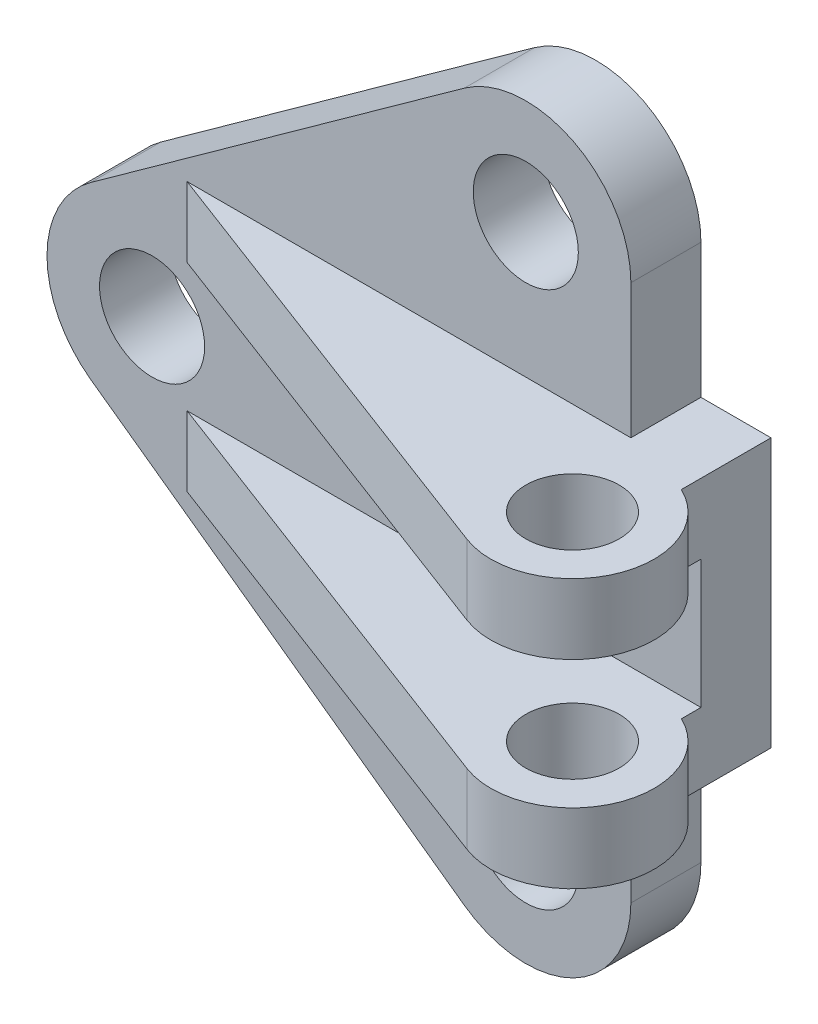
ISO-10303-21;
HEADER;
FILE_DESCRIPTION(('STEP AP214'),'2;1');
FILE_NAME('part.step','',(''),(''),'','','');
FILE_SCHEMA(('AUTOMOTIVE_DESIGN { 1 0 10303 214 1 1 1 1 }'));
ENDSEC;
DATA;
#1=APPLICATION_CONTEXT('core data for automotive mechanical design processes');
#2=APPLICATION_PROTOCOL_DEFINITION('international standard','automotive_design',2000,#1);
#3=PRODUCT_CONTEXT('',#1,'mechanical');
#4=PRODUCT('Part','Part','',(#3));
#5=PRODUCT_RELATED_PRODUCT_CATEGORY('part','',(#4));
#6=PRODUCT_DEFINITION_FORMATION('','',#4);
#7=PRODUCT_DEFINITION_CONTEXT('part definition',#1,'design');
#8=PRODUCT_DEFINITION('design','',#6,#7);
#9=PRODUCT_DEFINITION_SHAPE('','',#8);
#10=(LENGTH_UNIT() NAMED_UNIT(*) SI_UNIT(.MILLI.,.METRE.));
#11=(NAMED_UNIT(*) PLANE_ANGLE_UNIT() SI_UNIT($,.RADIAN.));
#12=(NAMED_UNIT(*) SI_UNIT($,.STERADIAN.) SOLID_ANGLE_UNIT());
#13=UNCERTAINTY_MEASURE_WITH_UNIT(LENGTH_MEASURE(1.E-05),#10,'distance_accuracy_value','');
#14=(GEOMETRIC_REPRESENTATION_CONTEXT(3) GLOBAL_UNCERTAINTY_ASSIGNED_CONTEXT((#13)) GLOBAL_UNIT_ASSIGNED_CONTEXT((#10,
#11,#12)) REPRESENTATION_CONTEXT('',''));
#15=CARTESIAN_POINT('',(0.,0.,0.));
#16=DIRECTION('',(0.,0.,1.));
#17=DIRECTION('',(1.,0.,0.));
#18=AXIS2_PLACEMENT_3D('',#15,#16,#17);
#19=CARTESIAN_POINT('',(0.,0.,12.));
#20=DIRECTION('',(0.,0.,1.));
#21=DIRECTION('',(1.,0.,0.));
#22=AXIS2_PLACEMENT_3D('',#19,#20,#21);
#23=PLANE('',#22);
#24=CARTESIAN_POINT('',(64.,46.,12.));
#25=DIRECTION('',(0.,0.,1.));
#26=DIRECTION('',(1.,0.,0.));
#27=AXIS2_PLACEMENT_3D('',#24,#25,#26);
#28=CIRCLE('',#27,9.);
#29=CARTESIAN_POINT('',(73.,46.,12.));
#30=VERTEX_POINT('',#29);
#31=EDGE_CURVE('E281',#30,#30,#28,.T.);
#32=ORIENTED_EDGE('',*,*,#31,.F.);
#33=EDGE_LOOP('',(#32));
#34=FACE_BOUND('',#33,.T.);
#35=CARTESIAN_POINT('',(0.,0.,12.));
#36=DIRECTION('',(0.,0.,1.));
#37=DIRECTION('',(1.,0.,0.));
#38=AXIS2_PLACEMENT_3D('',#35,#36,#37);
#39=CIRCLE('',#38,9.);
#40=CARTESIAN_POINT('',(9.,0.,12.));
#41=VERTEX_POINT('',#40);
#42=EDGE_CURVE('E289',#41,#41,#39,.T.);
#43=ORIENTED_EDGE('',*,*,#42,.F.);
#44=EDGE_LOOP('',(#43));
#45=FACE_BOUND('',#44,.T.);
#46=CARTESIAN_POINT('',(64.,-46.,12.));
#47=DIRECTION('',(0.,0.,1.));
#48=DIRECTION('',(1.,0.,0.));
#49=AXIS2_PLACEMENT_3D('',#46,#47,#48);
#50=CIRCLE('',#49,9.);
#51=CARTESIAN_POINT('',(73.,-46.,12.));
#52=VERTEX_POINT('',#51);
#53=EDGE_CURVE('E273',#52,#52,#50,.T.);
#54=ORIENTED_EDGE('',*,*,#53,.F.);
#55=EDGE_LOOP('',(#54));
#56=FACE_BOUND('',#55,.T.);
#57=DIRECTION('',(0.,-1.,0.));
#58=VECTOR('',#57,1.);
#59=CARTESIAN_POINT('',(94.,23.,12.));
#60=LINE('',#59,#58);
#61=CARTESIAN_POINT('',(94.,11.,12.));
#62=VERTEX_POINT('',#61);
#63=CARTESIAN_POINT('',(94.,-11.,12.));
#64=VERTEX_POINT('',#63);
#65=EDGE_CURVE('E60',#62,#64,#60,.T.);
#66=ORIENTED_EDGE('',*,*,#65,.F.);
#67=DIRECTION('',(1.,0.,0.));
#68=VECTOR('',#67,1.);
#69=CARTESIAN_POINT('',(5.99999999999999,11.,12.));
#70=LINE('',#69,#68);
#71=CARTESIAN_POINT('',(5.99999999999999,11.,12.));
#72=VERTEX_POINT('',#71);
#73=EDGE_CURVE('E158',#72,#62,#70,.T.);
#74=ORIENTED_EDGE('',*,*,#73,.F.);
#75=DIRECTION('',(0.,1.,0.));
#76=VECTOR('',#75,1.);
#77=CARTESIAN_POINT('',(5.99999999999999,11.,12.));
#78=LINE('',#77,#76);
#79=CARTESIAN_POINT('',(5.99999999999999,23.,12.));
#80=VERTEX_POINT('',#79);
#81=EDGE_CURVE('E172',#72,#80,#78,.T.);
#82=ORIENTED_EDGE('',*,*,#81,.T.);
#83=DIRECTION('',(1.,0.,0.));
#84=VECTOR('',#83,1.);
#85=CARTESIAN_POINT('',(5.99999999999999,23.,12.));
#86=LINE('',#85,#84);
#87=CARTESIAN_POINT('',(82.,23.,12.));
#88=VERTEX_POINT('',#87);
#89=EDGE_CURVE('E182',#80,#88,#86,.T.);
#90=ORIENTED_EDGE('',*,*,#89,.T.);
#91=DIRECTION('',(0.,1.,0.));
#92=VECTOR('',#91,1.);
#93=CARTESIAN_POINT('',(82.,46.,12.));
#94=LINE('',#93,#92);
#95=CARTESIAN_POINT('',(82.,46.,12.));
#96=VERTEX_POINT('',#95);
#97=EDGE_CURVE('E308',#88,#96,#94,.T.);
#98=ORIENTED_EDGE('',*,*,#97,.T.);
#99=CARTESIAN_POINT('',(64.,46.,12.));
#100=DIRECTION('',(0.,0.,1.));
#101=DIRECTION('',(1.,0.,0.));
#102=AXIS2_PLACEMENT_3D('',#99,#100,#101);
#103=CIRCLE('',#102,18.);
#104=CARTESIAN_POINT('',(53.4945511332536,60.6162766841688,12.));
#105=VERTEX_POINT('',#104);
#106=EDGE_CURVE('E313',#96,#105,#103,.T.);
#107=ORIENTED_EDGE('',*,*,#106,.T.);
#108=DIRECTION('',(-0.812015371342713,-0.583636048152575,0.));
#109=VECTOR('',#108,1.);
#110=CARTESIAN_POINT('',(-10.5054488667464,14.6162766841688,12.));
#111=LINE('',#110,#109);
#112=CARTESIAN_POINT('',(-10.5054488667464,14.6162766841688,12.));
#113=VERTEX_POINT('',#112);
#114=EDGE_CURVE('E316',#105,#113,#111,.T.);
#115=ORIENTED_EDGE('',*,*,#114,.T.);
#116=CARTESIAN_POINT('',(0.,0.,12.));
#117=DIRECTION('',(0.,0.,1.));
#118=DIRECTION('',(1.,0.,0.));
#119=AXIS2_PLACEMENT_3D('',#116,#117,#118);
#120=CIRCLE('',#119,18.);
#121=CARTESIAN_POINT('',(-10.5054488667464,-14.6162766841688,12.));
#122=VERTEX_POINT('',#121);
#123=EDGE_CURVE('E297',#113,#122,#120,.T.);
#124=ORIENTED_EDGE('',*,*,#123,.T.);
#125=DIRECTION('',(0.812015371342714,-0.583636048152575,0.));
#126=VECTOR('',#125,1.);
#127=CARTESIAN_POINT('',(-10.5054488667464,-14.6162766841688,12.));
#128=LINE('',#127,#126);
#129=CARTESIAN_POINT('',(53.4945511332537,-60.6162766841688,12.));
#130=VERTEX_POINT('',#129);
#131=EDGE_CURVE('E301',#122,#130,#128,.T.);
#132=ORIENTED_EDGE('',*,*,#131,.T.);
#133=CARTESIAN_POINT('',(64.,-46.,12.));
#134=DIRECTION('',(0.,0.,1.));
#135=DIRECTION('',(1.,0.,0.));
#136=AXIS2_PLACEMENT_3D('',#133,#134,#135);
#137=CIRCLE('',#136,18.);
#138=CARTESIAN_POINT('',(82.,-46.,12.));
#139=VERTEX_POINT('',#138);
#140=EDGE_CURVE('E305',#130,#139,#137,.T.);
#141=ORIENTED_EDGE('',*,*,#140,.T.);
#142=CARTESIAN_POINT('',(82.,-23.,12.));
#143=VERTEX_POINT('',#142);
#144=EDGE_CURVE('E309',#139,#143,#94,.T.);
#145=ORIENTED_EDGE('',*,*,#144,.T.);
#146=DIRECTION('',(1.,0.,0.));
#147=VECTOR('',#146,1.);
#148=CARTESIAN_POINT('',(5.99999999999999,-23.,12.));
#149=LINE('',#148,#147);
#150=CARTESIAN_POINT('',(5.99999999999999,-23.,12.));
#151=VERTEX_POINT('',#150);
#152=EDGE_CURVE('E217',#151,#143,#149,.T.);
#153=ORIENTED_EDGE('',*,*,#152,.F.);
#154=DIRECTION('',(0.,-1.,0.));
#155=VECTOR('',#154,1.);
#156=CARTESIAN_POINT('',(5.99999999999999,-11.,12.));
#157=LINE('',#156,#155);
#158=CARTESIAN_POINT('',(5.99999999999999,-11.,12.));
#159=VERTEX_POINT('',#158);
#160=EDGE_CURVE('E243',#159,#151,#157,.T.);
#161=ORIENTED_EDGE('',*,*,#160,.F.);
#162=DIRECTION('',(1.,0.,0.));
#163=VECTOR('',#162,1.);
#164=CARTESIAN_POINT('',(5.99999999999999,-11.,12.));
#165=LINE('',#164,#163);
#166=EDGE_CURVE('E221',#159,#64,#165,.T.);
#167=ORIENTED_EDGE('',*,*,#166,.T.);
#168=EDGE_LOOP('',(#66,#74,#82,#90,#98,#107,#115,#124,#132,#141,#145,#153,#161,#167));
#169=FACE_BOUND('',#168,.T.);
#170=ADVANCED_FACE('F39',(#34,#45,#56,#169),#23,.T.);
#171=CARTESIAN_POINT('',(82.,46.,12.));
#172=DIRECTION('',(-1.,0.,0.));
#173=DIRECTION('',(0.,0.,1.));
#174=AXIS2_PLACEMENT_3D('',#171,#172,#173);
#175=PLANE('',#174);
#176=DIRECTION('',(0.,0.,1.));
#177=VECTOR('',#176,1.);
#178=CARTESIAN_POINT('',(82.,23.,0.));
#179=LINE('',#178,#177);
#180=CARTESIAN_POINT('',(82.,23.,0.));
#181=VERTEX_POINT('',#180);
#182=EDGE_CURVE('E251',#181,#88,#179,.T.);
#183=ORIENTED_EDGE('',*,*,#182,.F.);
#184=DIRECTION('',(0.,1.,0.));
#185=VECTOR('',#184,1.);
#186=CARTESIAN_POINT('',(82.,46.,0.));
#187=LINE('',#186,#185);
#188=CARTESIAN_POINT('',(82.,46.,0.));
#189=VERTEX_POINT('',#188);
#190=EDGE_CURVE('E329',#181,#189,#187,.T.);
#191=ORIENTED_EDGE('',*,*,#190,.T.);
#192=DIRECTION('',(0.,0.,-1.));
#193=VECTOR('',#192,1.);
#194=CARTESIAN_POINT('',(82.,46.,12.));
#195=LINE('',#194,#193);
#196=EDGE_CURVE('E346',#96,#189,#195,.T.);
#197=ORIENTED_EDGE('',*,*,#196,.F.);
#198=ORIENTED_EDGE('',*,*,#97,.F.);
#199=EDGE_LOOP('',(#183,#191,#197,#198));
#200=FACE_BOUND('',#199,.T.);
#201=ADVANCED_FACE('F393',(#200),#175,.F.);
#202=CARTESIAN_POINT('',(0.,0.,0.));
#203=DIRECTION('',(0.,0.,1.));
#204=DIRECTION('',(1.,0.,0.));
#205=AXIS2_PLACEMENT_3D('',#202,#203,#204);
#206=PLANE('',#205);
#207=CARTESIAN_POINT('',(0.,0.,0.));
#208=DIRECTION('',(0.,0.,1.));
#209=DIRECTION('',(1.,0.,0.));
#210=AXIS2_PLACEMENT_3D('',#207,#208,#209);
#211=CIRCLE('',#210,18.);
#212=CARTESIAN_POINT('',(-10.5054488667464,14.6162766841688,0.));
#213=VERTEX_POINT('',#212);
#214=CARTESIAN_POINT('',(-10.5054488667464,-14.6162766841688,0.));
#215=VERTEX_POINT('',#214);
#216=EDGE_CURVE('E293',#213,#215,#211,.T.);
#217=ORIENTED_EDGE('',*,*,#216,.F.);
#218=DIRECTION('',(-0.812015371342713,-0.583636048152575,0.));
#219=VECTOR('',#218,1.);
#220=CARTESIAN_POINT('',(-10.5054488667464,14.6162766841688,0.));
#221=LINE('',#220,#219);
#222=CARTESIAN_POINT('',(53.4945511332536,60.6162766841688,0.));
#223=VERTEX_POINT('',#222);
#224=EDGE_CURVE('E302',#223,#213,#221,.T.);
#225=ORIENTED_EDGE('',*,*,#224,.F.);
#226=CARTESIAN_POINT('',(64.,46.,0.));
#227=DIRECTION('',(0.,0.,1.));
#228=DIRECTION('',(1.,0.,0.));
#229=AXIS2_PLACEMENT_3D('',#226,#227,#228);
#230=CIRCLE('',#229,18.);
#231=EDGE_CURVE('E334',#189,#223,#230,.T.);
#232=ORIENTED_EDGE('',*,*,#231,.F.);
#233=ORIENTED_EDGE('',*,*,#190,.F.);
#234=DIRECTION('',(-1.,0.,0.));
#235=VECTOR('',#234,1.);
#236=CARTESIAN_POINT('',(94.,23.,0.));
#237=LINE('',#236,#235);
#238=CARTESIAN_POINT('',(94.,23.,0.));
#239=VERTEX_POINT('',#238);
#240=EDGE_CURVE('E260',#239,#181,#237,.T.);
#241=ORIENTED_EDGE('',*,*,#240,.F.);
#242=DIRECTION('',(0.,-1.,0.));
#243=VECTOR('',#242,1.);
#244=CARTESIAN_POINT('',(94.,23.,0.));
#245=LINE('',#244,#243);
#246=CARTESIAN_POINT('',(94.,-23.,0.));
#247=VERTEX_POINT('',#246);
#248=EDGE_CURVE('E256',#239,#247,#245,.T.);
#249=ORIENTED_EDGE('',*,*,#248,.T.);
#250=DIRECTION('',(-1.,0.,0.));
#251=VECTOR('',#250,1.);
#252=CARTESIAN_POINT('',(94.,-23.,0.));
#253=LINE('',#252,#251);
#254=CARTESIAN_POINT('',(82.,-23.,0.));
#255=VERTEX_POINT('',#254);
#256=EDGE_CURVE('E267',#247,#255,#253,.T.);
#257=ORIENTED_EDGE('',*,*,#256,.T.);
#258=CARTESIAN_POINT('',(82.,-46.,0.));
#259=VERTEX_POINT('',#258);
#260=EDGE_CURVE('E330',#259,#255,#187,.T.);
#261=ORIENTED_EDGE('',*,*,#260,.F.);
#262=CARTESIAN_POINT('',(64.,-46.,0.));
#263=DIRECTION('',(0.,0.,1.));
#264=DIRECTION('',(1.,0.,0.));
#265=AXIS2_PLACEMENT_3D('',#262,#263,#264);
#266=CIRCLE('',#265,18.);
#267=CARTESIAN_POINT('',(53.4945511332537,-60.6162766841688,0.));
#268=VERTEX_POINT('',#267);
#269=EDGE_CURVE('E326',#268,#259,#266,.T.);
#270=ORIENTED_EDGE('',*,*,#269,.F.);
#271=DIRECTION('',(0.812015371342714,-0.583636048152575,0.));
#272=VECTOR('',#271,1.);
#273=CARTESIAN_POINT('',(-10.5054488667464,-14.6162766841688,0.));
#274=LINE('',#273,#272);
#275=EDGE_CURVE('E323',#215,#268,#274,.T.);
#276=ORIENTED_EDGE('',*,*,#275,.F.);
#277=EDGE_LOOP('',(#217,#225,#232,#233,#241,#249,#257,#261,#270,#276));
#278=FACE_BOUND('',#277,.T.);
#279=CARTESIAN_POINT('',(0.,0.,0.));
#280=DIRECTION('',(0.,0.,1.));
#281=DIRECTION('',(1.,0.,0.));
#282=AXIS2_PLACEMENT_3D('',#279,#280,#281);
#283=CIRCLE('',#282,9.);
#284=CARTESIAN_POINT('',(9.,0.,0.));
#285=VERTEX_POINT('',#284);
#286=EDGE_CURVE('E285',#285,#285,#283,.T.);
#287=ORIENTED_EDGE('',*,*,#286,.T.);
#288=EDGE_LOOP('',(#287));
#289=FACE_BOUND('',#288,.T.);
#290=CARTESIAN_POINT('',(64.,46.,0.));
#291=DIRECTION('',(0.,0.,1.));
#292=DIRECTION('',(1.,0.,0.));
#293=AXIS2_PLACEMENT_3D('',#290,#291,#292);
#294=CIRCLE('',#293,9.);
#295=CARTESIAN_POINT('',(73.,46.,0.));
#296=VERTEX_POINT('',#295);
#297=EDGE_CURVE('E277',#296,#296,#294,.T.);
#298=ORIENTED_EDGE('',*,*,#297,.T.);
#299=EDGE_LOOP('',(#298));
#300=FACE_BOUND('',#299,.T.);
#301=CARTESIAN_POINT('',(64.,-46.,0.));
#302=DIRECTION('',(0.,0.,1.));
#303=DIRECTION('',(1.,0.,0.));
#304=AXIS2_PLACEMENT_3D('',#301,#302,#303);
#305=CIRCLE('',#304,9.);
#306=CARTESIAN_POINT('',(73.,-46.,0.));
#307=VERTEX_POINT('',#306);
#308=EDGE_CURVE('E270',#307,#307,#305,.T.);
#309=ORIENTED_EDGE('',*,*,#308,.T.);
#310=EDGE_LOOP('',(#309));
#311=FACE_BOUND('',#310,.T.);
#312=ADVANCED_FACE('F365',(#278,#289,#300,#311),#206,.F.);
#313=CARTESIAN_POINT('',(0.,0.,12.));
#314=DIRECTION('',(0.,0.,-1.));
#315=DIRECTION('',(-1.,0.,0.));
#316=AXIS2_PLACEMENT_3D('',#313,#314,#315);
#317=CYLINDRICAL_SURFACE('',#316,18.);
#318=ORIENTED_EDGE('',*,*,#216,.T.);
#319=DIRECTION('',(0.,0.,-1.));
#320=VECTOR('',#319,1.);
#321=CARTESIAN_POINT('',(-10.5054488667464,-14.6162766841688,12.));
#322=LINE('',#321,#320);
#323=EDGE_CURVE('E11',#122,#215,#322,.T.);
#324=ORIENTED_EDGE('',*,*,#323,.F.);
#325=ORIENTED_EDGE('',*,*,#123,.F.);
#326=DIRECTION('',(0.,0.,-1.));
#327=VECTOR('',#326,1.);
#328=CARTESIAN_POINT('',(-10.5054488667464,14.6162766841688,12.));
#329=LINE('',#328,#327);
#330=EDGE_CURVE('E319',#113,#213,#329,.T.);
#331=ORIENTED_EDGE('',*,*,#330,.T.);
#332=EDGE_LOOP('',(#318,#324,#325,#331));
#333=FACE_BOUND('',#332,.T.);
#334=ADVANCED_FACE('F41',(#333),#317,.T.);
#335=CARTESIAN_POINT('',(-10.5054488667464,-14.6162766841688,12.));
#336=DIRECTION('',(0.583636048152575,0.812015371342713,0.));
#337=DIRECTION('',(-0.812015371342714,0.583636048152575,0.));
#338=AXIS2_PLACEMENT_3D('',#335,#336,#337);
#339=PLANE('',#338);
#340=ORIENTED_EDGE('',*,*,#275,.T.);
#341=DIRECTION('',(0.,0.,-1.));
#342=VECTOR('',#341,1.);
#343=CARTESIAN_POINT('',(53.4945511332537,-60.6162766841688,12.));
#344=LINE('',#343,#342);
#345=EDGE_CURVE('E48',#130,#268,#344,.T.);
#346=ORIENTED_EDGE('',*,*,#345,.F.);
#347=ORIENTED_EDGE('',*,*,#131,.F.);
#348=ORIENTED_EDGE('',*,*,#323,.T.);
#349=EDGE_LOOP('',(#340,#346,#347,#348));
#350=FACE_BOUND('',#349,.T.);
#351=ADVANCED_FACE('F376',(#350),#339,.F.);
#352=CARTESIAN_POINT('',(64.,-46.,12.));
#353=DIRECTION('',(0.,0.,-1.));
#354=DIRECTION('',(-1.,0.,0.));
#355=AXIS2_PLACEMENT_3D('',#352,#353,#354);
#356=CYLINDRICAL_SURFACE('',#355,18.);
#357=ORIENTED_EDGE('',*,*,#269,.T.);
#358=DIRECTION('',(0.,0.,-1.));
#359=VECTOR('',#358,1.);
#360=CARTESIAN_POINT('',(82.,-46.,12.));
#361=LINE('',#360,#359);
#362=EDGE_CURVE('E350',#139,#259,#361,.T.);
#363=ORIENTED_EDGE('',*,*,#362,.F.);
#364=ORIENTED_EDGE('',*,*,#140,.F.);
#365=ORIENTED_EDGE('',*,*,#345,.T.);
#366=EDGE_LOOP('',(#357,#363,#364,#365));
#367=FACE_BOUND('',#366,.T.);
#368=ADVANCED_FACE('F359',(#367),#356,.T.);
#369=ORIENTED_EDGE('',*,*,#260,.T.);
#370=DIRECTION('',(0.,0.,1.));
#371=VECTOR('',#370,1.);
#372=CARTESIAN_POINT('',(82.,-23.,0.));
#373=LINE('',#372,#371);
#374=EDGE_CURVE('E242',#255,#143,#373,.T.);
#375=ORIENTED_EDGE('',*,*,#374,.T.);
#376=ORIENTED_EDGE('',*,*,#144,.F.);
#377=ORIENTED_EDGE('',*,*,#362,.T.);
#378=EDGE_LOOP('',(#369,#375,#376,#377));
#379=FACE_BOUND('',#378,.T.);
#380=ADVANCED_FACE('F369',(#379),#175,.F.);
#381=CARTESIAN_POINT('',(64.,46.,12.));
#382=DIRECTION('',(0.,0.,-1.));
#383=DIRECTION('',(-1.,0.,0.));
#384=AXIS2_PLACEMENT_3D('',#381,#382,#383);
#385=CYLINDRICAL_SURFACE('',#384,18.);
#386=ORIENTED_EDGE('',*,*,#231,.T.);
#387=DIRECTION('',(0.,0.,-1.));
#388=VECTOR('',#387,1.);
#389=CARTESIAN_POINT('',(53.4945511332536,60.6162766841688,12.));
#390=LINE('',#389,#388);
#391=EDGE_CURVE('E342',#105,#223,#390,.T.);
#392=ORIENTED_EDGE('',*,*,#391,.F.);
#393=ORIENTED_EDGE('',*,*,#106,.F.);
#394=ORIENTED_EDGE('',*,*,#196,.T.);
#395=EDGE_LOOP('',(#386,#392,#393,#394));
#396=FACE_BOUND('',#395,.T.);
#397=ADVANCED_FACE('F388',(#396),#385,.T.);
#398=CARTESIAN_POINT('',(-10.5054488667464,14.6162766841688,12.));
#399=DIRECTION('',(0.583636048152575,-0.812015371342714,0.));
#400=DIRECTION('',(0.812015371342714,0.583636048152575,0.));
#401=AXIS2_PLACEMENT_3D('',#398,#399,#400);
#402=PLANE('',#401);
#403=ORIENTED_EDGE('',*,*,#224,.T.);
#404=ORIENTED_EDGE('',*,*,#330,.F.);
#405=ORIENTED_EDGE('',*,*,#114,.F.);
#406=ORIENTED_EDGE('',*,*,#391,.T.);
#407=EDGE_LOOP('',(#403,#404,#405,#406));
#408=FACE_BOUND('',#407,.T.);
#409=ADVANCED_FACE('F383',(#408),#402,.F.);
#410=CARTESIAN_POINT('',(0.,0.,12.));
#411=DIRECTION('',(0.,0.,-1.));
#412=DIRECTION('',(-1.,0.,0.));
#413=AXIS2_PLACEMENT_3D('',#410,#411,#412);
#414=CYLINDRICAL_SURFACE('',#413,9.);
#415=ORIENTED_EDGE('',*,*,#42,.T.);
#416=EDGE_LOOP('',(#415));
#417=FACE_BOUND('',#416,.T.);
#418=ORIENTED_EDGE('',*,*,#286,.F.);
#419=EDGE_LOOP('',(#418));
#420=FACE_BOUND('',#419,.T.);
#421=ADVANCED_FACE('F433',(#417,#420),#414,.F.);
#422=CARTESIAN_POINT('',(64.,46.,12.));
#423=DIRECTION('',(0.,0.,-1.));
#424=DIRECTION('',(-1.,0.,0.));
#425=AXIS2_PLACEMENT_3D('',#422,#423,#424);
#426=CYLINDRICAL_SURFACE('',#425,9.);
#427=ORIENTED_EDGE('',*,*,#31,.T.);
#428=EDGE_LOOP('',(#427));
#429=FACE_BOUND('',#428,.T.);
#430=ORIENTED_EDGE('',*,*,#297,.F.);
#431=EDGE_LOOP('',(#430));
#432=FACE_BOUND('',#431,.T.);
#433=ADVANCED_FACE('F539',(#429,#432),#426,.F.);
#434=CARTESIAN_POINT('',(64.,-46.,12.));
#435=DIRECTION('',(0.,0.,-1.));
#436=DIRECTION('',(-1.,0.,0.));
#437=AXIS2_PLACEMENT_3D('',#434,#435,#436);
#438=CYLINDRICAL_SURFACE('',#437,9.);
#439=ORIENTED_EDGE('',*,*,#53,.T.);
#440=EDGE_LOOP('',(#439));
#441=FACE_BOUND('',#440,.T.);
#442=ORIENTED_EDGE('',*,*,#308,.F.);
#443=EDGE_LOOP('',(#442));
#444=FACE_BOUND('',#443,.T.);
#445=ADVANCED_FACE('F534',(#441,#444),#438,.F.);
#446=CARTESIAN_POINT('',(94.,-23.,0.));
#447=DIRECTION('',(0.,-1.,0.));
#448=DIRECTION('',(0.,0.,-1.));
#449=AXIS2_PLACEMENT_3D('',#446,#447,#448);
#450=PLANE('',#449);
#451=ORIENTED_EDGE('',*,*,#374,.F.);
#452=ORIENTED_EDGE('',*,*,#256,.F.);
#453=DIRECTION('',(0.,0.,1.));
#454=VECTOR('',#453,1.);
#455=CARTESIAN_POINT('',(94.,-23.,0.));
#456=LINE('',#455,#454);
#457=CARTESIAN_POINT('',(94.,-23.,15.3508893593265));
#458=VERTEX_POINT('',#457);
#459=EDGE_CURVE('E248',#247,#458,#456,.T.);
#460=ORIENTED_EDGE('',*,*,#459,.T.);
#461=CARTESIAN_POINT('',(88.,-23.,28.));
#462=DIRECTION('',(0.,-1.,0.));
#463=DIRECTION('',(0.,0.,-1.));
#464=AXIS2_PLACEMENT_3D('',#461,#462,#463);
#465=CIRCLE('',#464,14.);
#466=CARTESIAN_POINT('',(83.0541877918841,-23.,41.0972875665938));
#467=VERTEX_POINT('',#466);
#468=EDGE_CURVE('E208',#458,#467,#465,.T.);
#469=ORIENTED_EDGE('',*,*,#468,.T.);
#470=DIRECTION('',(-0.935520540470985,0.,-0.353272300579704));
#471=VECTOR('',#470,1.);
#472=CARTESIAN_POINT('',(83.0541877918841,-23.,41.0972875665938));
#473=LINE('',#472,#471);
#474=EDGE_CURVE('E232',#467,#151,#473,.T.);
#475=ORIENTED_EDGE('',*,*,#474,.T.);
#476=ORIENTED_EDGE('',*,*,#152,.T.);
#477=EDGE_LOOP('',(#451,#452,#460,#469,#475,#476));
#478=FACE_BOUND('',#477,.T.);
#479=CARTESIAN_POINT('',(88.,-23.,28.));
#480=DIRECTION('',(0.,-1.,0.));
#481=DIRECTION('',(0.,0.,-1.));
#482=AXIS2_PLACEMENT_3D('',#479,#480,#481);
#483=CIRCLE('',#482,8.00000000000001);
#484=CARTESIAN_POINT('',(88.,-23.,20.));
#485=VERTEX_POINT('',#484);
#486=EDGE_CURVE('E200',#485,#485,#483,.T.);
#487=ORIENTED_EDGE('',*,*,#486,.F.);
#488=EDGE_LOOP('',(#487));
#489=FACE_BOUND('',#488,.T.);
#490=ADVANCED_FACE('F403',(#478,#489),#450,.T.);
#491=CARTESIAN_POINT('',(94.,23.,0.));
#492=DIRECTION('',(0.,-1.,0.));
#493=DIRECTION('',(0.,0.,-1.));
#494=AXIS2_PLACEMENT_3D('',#491,#492,#493);
#495=PLANE('',#494);
#496=ORIENTED_EDGE('',*,*,#182,.T.);
#497=ORIENTED_EDGE('',*,*,#89,.F.);
#498=DIRECTION('',(-0.935520540470985,0.,-0.353272300579704));
#499=VECTOR('',#498,1.);
#500=CARTESIAN_POINT('',(83.0541877918841,23.,41.0972875665938));
#501=LINE('',#500,#499);
#502=CARTESIAN_POINT('',(83.0541877918841,23.,41.0972875665938));
#503=VERTEX_POINT('',#502);
#504=EDGE_CURVE('E179',#503,#80,#501,.T.);
#505=ORIENTED_EDGE('',*,*,#504,.F.);
#506=CARTESIAN_POINT('',(88.,23.,28.));
#507=DIRECTION('',(0.,-1.,0.));
#508=DIRECTION('',(0.,0.,-1.));
#509=AXIS2_PLACEMENT_3D('',#506,#507,#508);
#510=CIRCLE('',#509,14.);
#511=CARTESIAN_POINT('',(94.,23.,15.3508893593265));
#512=VERTEX_POINT('',#511);
#513=EDGE_CURVE('E192',#512,#503,#510,.T.);
#514=ORIENTED_EDGE('',*,*,#513,.F.);
#515=DIRECTION('',(0.,0.,1.));
#516=VECTOR('',#515,1.);
#517=CARTESIAN_POINT('',(94.,23.,0.));
#518=LINE('',#517,#516);
#519=EDGE_CURVE('E167',#239,#512,#518,.T.);
#520=ORIENTED_EDGE('',*,*,#519,.F.);
#521=ORIENTED_EDGE('',*,*,#240,.T.);
#522=EDGE_LOOP('',(#496,#497,#505,#514,#520,#521));
#523=FACE_BOUND('',#522,.T.);
#524=CARTESIAN_POINT('',(88.,23.,28.));
#525=DIRECTION('',(0.,-1.,0.));
#526=DIRECTION('',(0.,0.,-1.));
#527=AXIS2_PLACEMENT_3D('',#524,#525,#526);
#528=CIRCLE('',#527,8.00000000000001);
#529=CARTESIAN_POINT('',(88.,23.,20.));
#530=VERTEX_POINT('',#529);
#531=EDGE_CURVE('E185',#530,#530,#528,.T.);
#532=ORIENTED_EDGE('',*,*,#531,.T.);
#533=EDGE_LOOP('',(#532));
#534=FACE_BOUND('',#533,.T.);
#535=ADVANCED_FACE('F399',(#523,#534),#495,.F.);
#536=CARTESIAN_POINT('',(94.,0.,0.));
#537=DIRECTION('',(1.,0.,0.));
#538=DIRECTION('',(0.,0.,-1.));
#539=AXIS2_PLACEMENT_3D('',#536,#537,#538);
#540=PLANE('',#539);
#541=ORIENTED_EDGE('',*,*,#459,.F.);
#542=ORIENTED_EDGE('',*,*,#248,.F.);
#543=ORIENTED_EDGE('',*,*,#519,.T.);
#544=DIRECTION('',(0.,1.,0.));
#545=VECTOR('',#544,1.);
#546=CARTESIAN_POINT('',(94.,11.,15.3508893593265));
#547=LINE('',#546,#545);
#548=CARTESIAN_POINT('',(94.,11.,15.3508893593265));
#549=VERTEX_POINT('',#548);
#550=EDGE_CURVE('E162',#549,#512,#547,.T.);
#551=ORIENTED_EDGE('',*,*,#550,.F.);
#552=DIRECTION('',(0.,0.,1.));
#553=VECTOR('',#552,1.);
#554=CARTESIAN_POINT('',(94.,11.,12.));
#555=LINE('',#554,#553);
#556=EDGE_CURVE('E55',#62,#549,#555,.T.);
#557=ORIENTED_EDGE('',*,*,#556,.F.);
#558=ORIENTED_EDGE('',*,*,#65,.T.);
#559=DIRECTION('',(0.,0.,1.));
#560=VECTOR('',#559,1.);
#561=CARTESIAN_POINT('',(94.,-11.,12.));
#562=LINE('',#561,#560);
#563=CARTESIAN_POINT('',(94.,-11.,15.3508893593265));
#564=VERTEX_POINT('',#563);
#565=EDGE_CURVE('E225',#64,#564,#562,.T.);
#566=ORIENTED_EDGE('',*,*,#565,.T.);
#567=DIRECTION('',(0.,-1.,0.));
#568=VECTOR('',#567,1.);
#569=CARTESIAN_POINT('',(94.,-11.,15.3508893593265));
#570=LINE('',#569,#568);
#571=EDGE_CURVE('E238',#564,#458,#570,.T.);
#572=ORIENTED_EDGE('',*,*,#571,.T.);
#573=EDGE_LOOP('',(#541,#542,#543,#551,#557,#558,#566,#572));
#574=FACE_BOUND('',#573,.T.);
#575=ADVANCED_FACE('F164',(#574),#540,.T.);
#576=CARTESIAN_POINT('',(88.,-11.,28.));
#577=DIRECTION('',(0.,-1.,0.));
#578=DIRECTION('',(0.,0.,-1.));
#579=AXIS2_PLACEMENT_3D('',#576,#577,#578);
#580=CYLINDRICAL_SURFACE('',#579,14.);
#581=ORIENTED_EDGE('',*,*,#468,.F.);
#582=ORIENTED_EDGE('',*,*,#571,.F.);
#583=CARTESIAN_POINT('',(88.,-11.,28.));
#584=DIRECTION('',(0.,-1.,0.));
#585=DIRECTION('',(0.,0.,-1.));
#586=AXIS2_PLACEMENT_3D('',#583,#584,#585);
#587=CIRCLE('',#586,14.);
#588=CARTESIAN_POINT('',(83.0541877918841,-11.,41.0972875665938));
#589=VERTEX_POINT('',#588);
#590=EDGE_CURVE('E212',#564,#589,#587,.T.);
#591=ORIENTED_EDGE('',*,*,#590,.T.);
#592=DIRECTION('',(0.,-1.,0.));
#593=VECTOR('',#592,1.);
#594=CARTESIAN_POINT('',(83.0541877918841,-11.,41.0972875665938));
#595=LINE('',#594,#593);
#596=EDGE_CURVE('E228',#589,#467,#595,.T.);
#597=ORIENTED_EDGE('',*,*,#596,.T.);
#598=EDGE_LOOP('',(#581,#582,#591,#597));
#599=FACE_BOUND('',#598,.T.);
#600=ADVANCED_FACE('F413',(#599),#580,.T.);
#601=CARTESIAN_POINT('',(83.0541877918841,-11.,41.0972875665938));
#602=DIRECTION('',(-0.353272300579704,0.,0.935520540470985));
#603=DIRECTION('',(0.935520540470985,0.,0.353272300579704));
#604=AXIS2_PLACEMENT_3D('',#601,#602,#603);
#605=PLANE('',#604);
#606=ORIENTED_EDGE('',*,*,#474,.F.);
#607=ORIENTED_EDGE('',*,*,#596,.F.);
#608=DIRECTION('',(-0.935520540470985,0.,-0.353272300579704));
#609=VECTOR('',#608,1.);
#610=CARTESIAN_POINT('',(83.0541877918841,-11.,41.0972875665938));
#611=LINE('',#610,#609);
#612=EDGE_CURVE('E216',#589,#159,#611,.T.);
#613=ORIENTED_EDGE('',*,*,#612,.T.);
#614=ORIENTED_EDGE('',*,*,#160,.T.);
#615=EDGE_LOOP('',(#606,#607,#613,#614));
#616=FACE_BOUND('',#615,.T.);
#617=ADVANCED_FACE('F407',(#616),#605,.T.);
#618=CARTESIAN_POINT('',(88.,-11.,28.));
#619=DIRECTION('',(0.,-1.,0.));
#620=DIRECTION('',(0.,0.,-1.));
#621=AXIS2_PLACEMENT_3D('',#618,#619,#620);
#622=PLANE('',#621);
#623=CARTESIAN_POINT('',(88.,-11.,28.));
#624=DIRECTION('',(0.,-1.,0.));
#625=DIRECTION('',(0.,0.,-1.));
#626=AXIS2_PLACEMENT_3D('',#623,#624,#625);
#627=CIRCLE('',#626,8.00000000000001);
#628=CARTESIAN_POINT('',(88.,-11.,20.));
#629=VERTEX_POINT('',#628);
#630=EDGE_CURVE('E204',#629,#629,#627,.T.);
#631=ORIENTED_EDGE('',*,*,#630,.T.);
#632=EDGE_LOOP('',(#631));
#633=FACE_BOUND('',#632,.T.);
#634=ORIENTED_EDGE('',*,*,#590,.F.);
#635=ORIENTED_EDGE('',*,*,#565,.F.);
#636=ORIENTED_EDGE('',*,*,#166,.F.);
#637=ORIENTED_EDGE('',*,*,#612,.F.);
#638=EDGE_LOOP('',(#634,#635,#636,#637));
#639=FACE_BOUND('',#638,.T.);
#640=ADVANCED_FACE('F411',(#633,#639),#622,.F.);
#641=CARTESIAN_POINT('',(88.,-11.,28.));
#642=DIRECTION('',(0.,-1.,0.));
#643=DIRECTION('',(0.,0.,-1.));
#644=AXIS2_PLACEMENT_3D('',#641,#642,#643);
#645=CYLINDRICAL_SURFACE('',#644,8.00000000000001);
#646=ORIENTED_EDGE('',*,*,#630,.F.);
#647=EDGE_LOOP('',(#646));
#648=FACE_BOUND('',#647,.T.);
#649=ORIENTED_EDGE('',*,*,#486,.T.);
#650=EDGE_LOOP('',(#649));
#651=FACE_BOUND('',#650,.T.);
#652=ADVANCED_FACE('F489',(#648,#651),#645,.F.);
#653=CARTESIAN_POINT('',(88.,11.,28.));
#654=DIRECTION('',(0.,1.,0.));
#655=DIRECTION('',(0.,0.,-1.));
#656=AXIS2_PLACEMENT_3D('',#653,#654,#655);
#657=PLANE('',#656);
#658=CARTESIAN_POINT('',(88.,11.,28.));
#659=DIRECTION('',(0.,-1.,0.));
#660=DIRECTION('',(0.,0.,-1.));
#661=AXIS2_PLACEMENT_3D('',#658,#659,#660);
#662=CIRCLE('',#661,14.);
#663=CARTESIAN_POINT('',(83.0541877918841,11.,41.0972875665938));
#664=VERTEX_POINT('',#663);
#665=EDGE_CURVE('E155',#549,#664,#662,.T.);
#666=ORIENTED_EDGE('',*,*,#665,.T.);
#667=DIRECTION('',(-0.935520540470985,0.,-0.353272300579704));
#668=VECTOR('',#667,1.);
#669=CARTESIAN_POINT('',(83.0541877918841,11.,41.0972875665938));
#670=LINE('',#669,#668);
#671=EDGE_CURVE('E173',#664,#72,#670,.T.);
#672=ORIENTED_EDGE('',*,*,#671,.T.);
#673=ORIENTED_EDGE('',*,*,#73,.T.);
#674=ORIENTED_EDGE('',*,*,#556,.T.);
#675=EDGE_LOOP('',(#666,#672,#673,#674));
#676=FACE_BOUND('',#675,.T.);
#677=CARTESIAN_POINT('',(88.,11.,28.));
#678=DIRECTION('',(0.,-1.,0.));
#679=DIRECTION('',(0.,0.,-1.));
#680=AXIS2_PLACEMENT_3D('',#677,#678,#679);
#681=CIRCLE('',#680,8.00000000000001);
#682=CARTESIAN_POINT('',(88.,11.,20.));
#683=VERTEX_POINT('',#682);
#684=EDGE_CURVE('E195',#683,#683,#681,.T.);
#685=ORIENTED_EDGE('',*,*,#684,.F.);
#686=EDGE_LOOP('',(#685));
#687=FACE_BOUND('',#686,.T.);
#688=ADVANCED_FACE('F152',(#676,#687),#657,.F.);
#689=CARTESIAN_POINT('',(88.,11.,28.));
#690=DIRECTION('',(0.,1.,0.));
#691=DIRECTION('',(0.,0.,1.));
#692=AXIS2_PLACEMENT_3D('',#689,#690,#691);
#693=CYLINDRICAL_SURFACE('',#692,14.);
#694=ORIENTED_EDGE('',*,*,#513,.T.);
#695=DIRECTION('',(0.,1.,0.));
#696=VECTOR('',#695,1.);
#697=CARTESIAN_POINT('',(83.0541877918841,11.,41.0972875665938));
#698=LINE('',#697,#696);
#699=EDGE_CURVE('E177',#664,#503,#698,.T.);
#700=ORIENTED_EDGE('',*,*,#699,.F.);
#701=ORIENTED_EDGE('',*,*,#665,.F.);
#702=ORIENTED_EDGE('',*,*,#550,.T.);
#703=EDGE_LOOP('',(#694,#700,#701,#702));
#704=FACE_BOUND('',#703,.T.);
#705=ADVANCED_FACE('F175',(#704),#693,.T.);
#706=CARTESIAN_POINT('',(83.0541877918841,11.,41.0972875665938));
#707=DIRECTION('',(0.353272300579704,0.,-0.935520540470985));
#708=DIRECTION('',(-0.935520540470985,0.,-0.353272300579704));
#709=AXIS2_PLACEMENT_3D('',#706,#707,#708);
#710=PLANE('',#709);
#711=ORIENTED_EDGE('',*,*,#504,.T.);
#712=ORIENTED_EDGE('',*,*,#81,.F.);
#713=ORIENTED_EDGE('',*,*,#671,.F.);
#714=ORIENTED_EDGE('',*,*,#699,.T.);
#715=EDGE_LOOP('',(#711,#712,#713,#714));
#716=FACE_BOUND('',#715,.T.);
#717=ADVANCED_FACE('F499',(#716),#710,.F.);
#718=CARTESIAN_POINT('',(88.,11.,28.));
#719=DIRECTION('',(0.,1.,0.));
#720=DIRECTION('',(0.,0.,1.));
#721=AXIS2_PLACEMENT_3D('',#718,#719,#720);
#722=CYLINDRICAL_SURFACE('',#721,8.00000000000001);
#723=ORIENTED_EDGE('',*,*,#684,.T.);
#724=EDGE_LOOP('',(#723));
#725=FACE_BOUND('',#724,.T.);
#726=ORIENTED_EDGE('',*,*,#531,.F.);
#727=EDGE_LOOP('',(#726));
#728=FACE_BOUND('',#727,.T.);
#729=ADVANCED_FACE('F508',(#725,#728),#722,.F.);
#730=CLOSED_SHELL('',(#170,#201,#312,#334,#351,#368,#380,#397,#409,#421,#433,#445,#490,#535,
#575,#600,#617,#640,#652,#688,#705,#717,#729));
#731=MANIFOLD_SOLID_BREP('B2',#730);
#732=ADVANCED_BREP_SHAPE_REPRESENTATION('',(#18,#731),#14);
#733=SHAPE_DEFINITION_REPRESENTATION(#9,#732);
ENDSEC;
END-ISO-10303-21;
